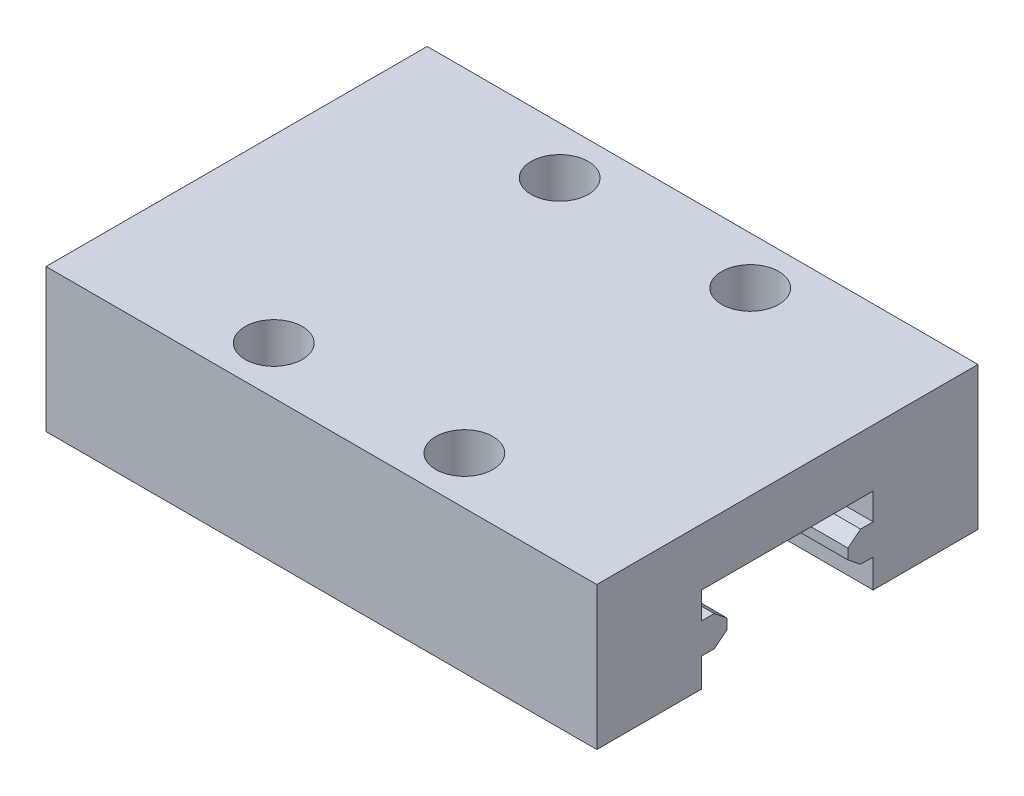
ISO-10303-21;
HEADER;
FILE_DESCRIPTION(('STEP AP214'),'2;1');
FILE_NAME('part.step','',(''),(''),'','','');
FILE_SCHEMA(('AUTOMOTIVE_DESIGN { 1 0 10303 214 1 1 1 1 }'));
ENDSEC;
DATA;
#1=APPLICATION_CONTEXT('core data for automotive mechanical design processes');
#2=APPLICATION_PROTOCOL_DEFINITION('international standard','automotive_design',2000,#1);
#3=PRODUCT_CONTEXT('',#1,'mechanical');
#4=PRODUCT('Part','Part','',(#3));
#5=PRODUCT_RELATED_PRODUCT_CATEGORY('part','',(#4));
#6=PRODUCT_DEFINITION_FORMATION('','',#4);
#7=PRODUCT_DEFINITION_CONTEXT('part definition',#1,'design');
#8=PRODUCT_DEFINITION('design','',#6,#7);
#9=PRODUCT_DEFINITION_SHAPE('','',#8);
#10=(LENGTH_UNIT() NAMED_UNIT(*) SI_UNIT(.MILLI.,.METRE.));
#11=(NAMED_UNIT(*) PLANE_ANGLE_UNIT() SI_UNIT($,.RADIAN.));
#12=(NAMED_UNIT(*) SI_UNIT($,.STERADIAN.) SOLID_ANGLE_UNIT());
#13=UNCERTAINTY_MEASURE_WITH_UNIT(LENGTH_MEASURE(1.E-05),#10,'distance_accuracy_value','');
#14=(GEOMETRIC_REPRESENTATION_CONTEXT(3) GLOBAL_UNCERTAINTY_ASSIGNED_CONTEXT((#13)) GLOBAL_UNIT_ASSIGNED_CONTEXT((#10,
#11,#12)) REPRESENTATION_CONTEXT('',''));
#15=CARTESIAN_POINT('',(0.,0.,0.));
#16=DIRECTION('',(0.,0.,1.));
#17=DIRECTION('',(1.,0.,0.));
#18=AXIS2_PLACEMENT_3D('',#15,#16,#17);
#19=CARTESIAN_POINT('',(28.9,2.03,-13.175));
#20=DIRECTION('',(0.,0.,-1.));
#21=DIRECTION('',(-1.,0.,0.));
#22=AXIS2_PLACEMENT_3D('',#19,#20,#21);
#23=PLANE('',#22);
#24=DIRECTION('',(-1.,0.,0.));
#25=VECTOR('',#24,1.);
#26=CARTESIAN_POINT('',(14.45,2.57,-13.175));
#27=LINE('',#26,#25);
#28=CARTESIAN_POINT('',(28.9,2.570000000625,-13.175));
#29=VERTEX_POINT('',#28);
#30=CARTESIAN_POINT('',(0.,2.570000000625,-13.175));
#31=VERTEX_POINT('',#30);
#32=EDGE_CURVE('E171',#29,#31,#27,.T.);
#33=ORIENTED_EDGE('',*,*,#32,.T.);
#34=DIRECTION('',(0.,1.,0.));
#35=VECTOR('',#34,1.);
#36=CARTESIAN_POINT('',(0.,2.3,-13.175));
#37=LINE('',#36,#35);
#38=CARTESIAN_POINT('',(0.,2.03000000125,-13.175));
#39=VERTEX_POINT('',#38);
#40=EDGE_CURVE('E158',#39,#31,#37,.T.);
#41=ORIENTED_EDGE('',*,*,#40,.F.);
#42=DIRECTION('',(1.,0.,0.));
#43=VECTOR('',#42,1.);
#44=CARTESIAN_POINT('',(14.45,2.03,-13.175));
#45=LINE('',#44,#43);
#46=CARTESIAN_POINT('',(28.9,2.030000000625,-13.175));
#47=VERTEX_POINT('',#46);
#48=EDGE_CURVE('E324',#39,#47,#45,.T.);
#49=ORIENTED_EDGE('',*,*,#48,.T.);
#50=DIRECTION('',(0.,-1.,0.));
#51=VECTOR('',#50,1.);
#52=CARTESIAN_POINT('',(28.9,2.3,-13.175));
#53=LINE('',#52,#51);
#54=EDGE_CURVE('E153',#29,#47,#53,.T.);
#55=ORIENTED_EDGE('',*,*,#54,.F.);
#56=EDGE_LOOP('',(#33,#41,#49,#55));
#57=FACE_BOUND('',#56,.T.);
#58=ADVANCED_FACE('F17',(#57),#23,.F.);
#59=CARTESIAN_POINT('',(0.,2.03,-6.825));
#60=DIRECTION('',(0.,0.,1.));
#61=DIRECTION('',(1.,0.,0.));
#62=AXIS2_PLACEMENT_3D('',#59,#60,#61);
#63=PLANE('',#62);
#64=DIRECTION('',(-1.,0.,0.));
#65=VECTOR('',#64,1.);
#66=CARTESIAN_POINT('',(14.45,2.03,-6.825));
#67=LINE('',#66,#65);
#68=CARTESIAN_POINT('',(28.9,2.030000000625,-6.825));
#69=VERTEX_POINT('',#68);
#70=CARTESIAN_POINT('',(0.,2.030000000625,-6.825));
#71=VERTEX_POINT('',#70);
#72=EDGE_CURVE('E319',#69,#71,#67,.T.);
#73=ORIENTED_EDGE('',*,*,#72,.T.);
#74=DIRECTION('',(0.,-1.,0.));
#75=VECTOR('',#74,1.);
#76=CARTESIAN_POINT('',(0.,2.3,-6.825));
#77=LINE('',#76,#75);
#78=CARTESIAN_POINT('',(0.,2.57000000125,-6.825));
#79=VERTEX_POINT('',#78);
#80=EDGE_CURVE('E179',#79,#71,#77,.T.);
#81=ORIENTED_EDGE('',*,*,#80,.F.);
#82=DIRECTION('',(1.,0.,0.));
#83=VECTOR('',#82,1.);
#84=CARTESIAN_POINT('',(14.45,2.57,-6.825));
#85=LINE('',#84,#83);
#86=CARTESIAN_POINT('',(28.9,2.570000000625,-6.825));
#87=VERTEX_POINT('',#86);
#88=EDGE_CURVE('E329',#79,#87,#85,.T.);
#89=ORIENTED_EDGE('',*,*,#88,.T.);
#90=DIRECTION('',(0.,1.,0.));
#91=VECTOR('',#90,1.);
#92=CARTESIAN_POINT('',(28.9,2.3,-6.825));
#93=LINE('',#92,#91);
#94=EDGE_CURVE('E177',#69,#87,#93,.T.);
#95=ORIENTED_EDGE('',*,*,#94,.F.);
#96=EDGE_LOOP('',(#73,#81,#89,#95));
#97=FACE_BOUND('',#96,.T.);
#98=ADVANCED_FACE('F368',(#97),#63,.F.);
#99=CARTESIAN_POINT('',(0.,2.57,-13.175));
#100=DIRECTION('',(0.,-0.78086880944303,-0.624695047554425));
#101=DIRECTION('',(0.,0.624695047554425,-0.78086880944303));
#102=AXIS2_PLACEMENT_3D('',#99,#100,#101);
#103=PLANE('',#102);
#104=DIRECTION('',(-1.,0.,0.));
#105=VECTOR('',#104,1.);
#106=CARTESIAN_POINT('',(14.45,3.1,-13.8375));
#107=LINE('',#106,#105);
#108=CARTESIAN_POINT('',(28.9,3.099999999375,-13.8375));
#109=VERTEX_POINT('',#108);
#110=CARTESIAN_POINT('',(0.,3.099999999375,-13.8375));
#111=VERTEX_POINT('',#110);
#112=EDGE_CURVE('E174',#109,#111,#107,.T.);
#113=ORIENTED_EDGE('',*,*,#112,.T.);
#114=DIRECTION('',(0.,0.624695047554425,-0.78086880944303));
#115=VECTOR('',#114,1.);
#116=CARTESIAN_POINT('',(0.,2.835,-13.50625));
#117=LINE('',#116,#115);
#118=EDGE_CURVE('E162',#31,#111,#117,.T.);
#119=ORIENTED_EDGE('',*,*,#118,.F.);
#120=ORIENTED_EDGE('',*,*,#32,.F.);
#121=DIRECTION('',(0.,-0.624695047554425,0.78086880944303));
#122=VECTOR('',#121,1.);
#123=CARTESIAN_POINT('',(28.9,2.835,-13.50625));
#124=LINE('',#123,#122);
#125=EDGE_CURVE('E175',#109,#29,#124,.T.);
#126=ORIENTED_EDGE('',*,*,#125,.F.);
#127=EDGE_LOOP('',(#113,#119,#120,#126));
#128=FACE_BOUND('',#127,.T.);
#129=ADVANCED_FACE('F170',(#128),#103,.F.);
#130=CARTESIAN_POINT('',(0.,3.1,-6.1625));
#131=DIRECTION('',(0.,-0.78086880944303,0.624695047554424));
#132=DIRECTION('',(0.,-0.624695047554424,-0.78086880944303));
#133=AXIS2_PLACEMENT_3D('',#130,#131,#132);
#134=PLANE('',#133);
#135=ORIENTED_EDGE('',*,*,#88,.F.);
#136=DIRECTION('',(0.,-0.624695047554424,-0.78086880944303));
#137=VECTOR('',#136,1.);
#138=CARTESIAN_POINT('',(0.,2.835,-6.49375));
#139=LINE('',#138,#137);
#140=CARTESIAN_POINT('',(0.,3.09999999875,-6.1625));
#141=VERTEX_POINT('',#140);
#142=EDGE_CURVE('E332',#141,#79,#139,.T.);
#143=ORIENTED_EDGE('',*,*,#142,.F.);
#144=DIRECTION('',(1.,0.,0.));
#145=VECTOR('',#144,1.);
#146=CARTESIAN_POINT('',(14.45,3.1,-6.1625));
#147=LINE('',#146,#145);
#148=CARTESIAN_POINT('',(28.9,3.099999999375,-6.1625));
#149=VERTEX_POINT('',#148);
#150=EDGE_CURVE('E302',#141,#149,#147,.T.);
#151=ORIENTED_EDGE('',*,*,#150,.T.);
#152=DIRECTION('',(0.,0.624695047554424,0.78086880944303));
#153=VECTOR('',#152,1.);
#154=CARTESIAN_POINT('',(28.9,2.835,-6.49375));
#155=LINE('',#154,#153);
#156=EDGE_CURVE('E327',#87,#149,#155,.T.);
#157=ORIENTED_EDGE('',*,*,#156,.F.);
#158=EDGE_LOOP('',(#135,#143,#151,#157));
#159=FACE_BOUND('',#158,.T.);
#160=ADVANCED_FACE('F360',(#159),#134,.F.);
#161=CARTESIAN_POINT('',(0.,1.5,-13.8375));
#162=DIRECTION('',(0.,0.780868809443031,-0.624695047554424));
#163=DIRECTION('',(0.,0.624695047554424,0.780868809443031));
#164=AXIS2_PLACEMENT_3D('',#161,#162,#163);
#165=PLANE('',#164);
#166=ORIENTED_EDGE('',*,*,#48,.F.);
#167=DIRECTION('',(0.,0.624695047554424,0.78086880944303));
#168=VECTOR('',#167,1.);
#169=CARTESIAN_POINT('',(0.,1.765,-13.50625));
#170=LINE('',#169,#168);
#171=CARTESIAN_POINT('',(0.,1.5,-13.8375));
#172=VERTEX_POINT('',#171);
#173=EDGE_CURVE('E165',#172,#39,#170,.T.);
#174=ORIENTED_EDGE('',*,*,#173,.F.);
#175=DIRECTION('',(1.,0.,0.));
#176=VECTOR('',#175,1.);
#177=CARTESIAN_POINT('',(14.45,1.5,-13.8375));
#178=LINE('',#177,#176);
#179=CARTESIAN_POINT('',(28.9,1.5,-13.8375));
#180=VERTEX_POINT('',#179);
#181=EDGE_CURVE('E295',#172,#180,#178,.T.);
#182=ORIENTED_EDGE('',*,*,#181,.T.);
#183=DIRECTION('',(0.,-0.624695047554424,-0.78086880944303));
#184=VECTOR('',#183,1.);
#185=CARTESIAN_POINT('',(28.9,1.765,-13.50625));
#186=LINE('',#185,#184);
#187=EDGE_CURVE('E322',#47,#180,#186,.T.);
#188=ORIENTED_EDGE('',*,*,#187,.F.);
#189=EDGE_LOOP('',(#166,#174,#182,#188));
#190=FACE_BOUND('',#189,.T.);
#191=ADVANCED_FACE('F407',(#190),#165,.F.);
#192=CARTESIAN_POINT('',(0.,2.03,-6.825));
#193=DIRECTION('',(0.,0.780868809443031,0.624695047554424));
#194=DIRECTION('',(0.,-0.624695047554424,0.780868809443031));
#195=AXIS2_PLACEMENT_3D('',#192,#193,#194);
#196=PLANE('',#195);
#197=DIRECTION('',(-1.,0.,0.));
#198=VECTOR('',#197,1.);
#199=CARTESIAN_POINT('',(14.45,1.5,-6.1625));
#200=LINE('',#199,#198);
#201=CARTESIAN_POINT('',(28.9,1.5,-6.1625));
#202=VERTEX_POINT('',#201);
#203=CARTESIAN_POINT('',(0.,1.5,-6.1625));
#204=VERTEX_POINT('',#203);
#205=EDGE_CURVE('E290',#202,#204,#200,.T.);
#206=ORIENTED_EDGE('',*,*,#205,.T.);
#207=DIRECTION('',(0.,-0.624695047554424,0.780868809443031));
#208=VECTOR('',#207,1.);
#209=CARTESIAN_POINT('',(0.,1.765,-6.49375));
#210=LINE('',#209,#208);
#211=EDGE_CURVE('E317',#71,#204,#210,.T.);
#212=ORIENTED_EDGE('',*,*,#211,.F.);
#213=ORIENTED_EDGE('',*,*,#72,.F.);
#214=DIRECTION('',(0.,0.624695047554424,-0.780868809443031));
#215=VECTOR('',#214,1.);
#216=CARTESIAN_POINT('',(28.9,1.765,-6.49375));
#217=LINE('',#216,#215);
#218=EDGE_CURVE('E314',#202,#69,#217,.T.);
#219=ORIENTED_EDGE('',*,*,#218,.F.);
#220=EDGE_LOOP('',(#206,#212,#213,#219));
#221=FACE_BOUND('',#220,.T.);
#222=ADVANCED_FACE('F366',(#221),#196,.F.);
#223=CARTESIAN_POINT('',(0.,3.1,-13.8375));
#224=DIRECTION('',(0.,-1.,0.));
#225=DIRECTION('',(0.,0.,-1.));
#226=AXIS2_PLACEMENT_3D('',#223,#224,#225);
#227=PLANE('',#226);
#228=DIRECTION('',(-1.,0.,0.));
#229=VECTOR('',#228,1.);
#230=CARTESIAN_POINT('',(14.45,3.1,-14.5));
#231=LINE('',#230,#229);
#232=CARTESIAN_POINT('',(28.9,3.099999999375,-14.5));
#233=VERTEX_POINT('',#232);
#234=CARTESIAN_POINT('',(0.,3.099999999375,-14.5));
#235=VERTEX_POINT('',#234);
#236=EDGE_CURVE('E282',#233,#235,#231,.T.);
#237=ORIENTED_EDGE('',*,*,#236,.T.);
#238=DIRECTION('',(0.,0.,-1.));
#239=VECTOR('',#238,1.);
#240=CARTESIAN_POINT('',(0.,3.1,-14.16875));
#241=LINE('',#240,#239);
#242=EDGE_CURVE('E311',#111,#235,#241,.T.);
#243=ORIENTED_EDGE('',*,*,#242,.F.);
#244=ORIENTED_EDGE('',*,*,#112,.F.);
#245=DIRECTION('',(0.,0.,1.));
#246=VECTOR('',#245,1.);
#247=CARTESIAN_POINT('',(28.9,3.1,-14.16875));
#248=LINE('',#247,#246);
#249=EDGE_CURVE('E308',#233,#109,#248,.T.);
#250=ORIENTED_EDGE('',*,*,#249,.F.);
#251=EDGE_LOOP('',(#237,#243,#244,#250));
#252=FACE_BOUND('',#251,.T.);
#253=ADVANCED_FACE('F338',(#252),#227,.F.);
#254=CARTESIAN_POINT('',(0.,3.1,-5.5));
#255=DIRECTION('',(0.,-1.,0.));
#256=DIRECTION('',(0.,0.,-1.));
#257=AXIS2_PLACEMENT_3D('',#254,#255,#256);
#258=PLANE('',#257);
#259=ORIENTED_EDGE('',*,*,#150,.F.);
#260=DIRECTION('',(0.,0.,-1.));
#261=VECTOR('',#260,1.);
#262=CARTESIAN_POINT('',(0.,3.1,-5.83125));
#263=LINE('',#262,#261);
#264=CARTESIAN_POINT('',(0.,3.09999999875,-5.5));
#265=VERTEX_POINT('',#264);
#266=EDGE_CURVE('E305',#265,#141,#263,.T.);
#267=ORIENTED_EDGE('',*,*,#266,.F.);
#268=DIRECTION('',(1.,0.,0.));
#269=VECTOR('',#268,1.);
#270=CARTESIAN_POINT('',(14.45,3.1,-5.5));
#271=LINE('',#270,#269);
#272=CARTESIAN_POINT('',(28.9,3.099999999375,-5.5));
#273=VERTEX_POINT('',#272);
#274=EDGE_CURVE('E271',#265,#273,#271,.T.);
#275=ORIENTED_EDGE('',*,*,#274,.T.);
#276=DIRECTION('',(0.,0.,1.));
#277=VECTOR('',#276,1.);
#278=CARTESIAN_POINT('',(28.9,3.1,-5.83125));
#279=LINE('',#278,#277);
#280=EDGE_CURVE('E300',#149,#273,#279,.T.);
#281=ORIENTED_EDGE('',*,*,#280,.F.);
#282=EDGE_LOOP('',(#259,#267,#275,#281));
#283=FACE_BOUND('',#282,.T.);
#284=ADVANCED_FACE('F356',(#283),#258,.F.);
#285=CARTESIAN_POINT('',(0.,1.5,-14.5));
#286=DIRECTION('',(0.,1.,0.));
#287=DIRECTION('',(0.,0.,1.));
#288=AXIS2_PLACEMENT_3D('',#285,#286,#287);
#289=PLANE('',#288);
#290=ORIENTED_EDGE('',*,*,#181,.F.);
#291=DIRECTION('',(0.,0.,1.));
#292=VECTOR('',#291,1.);
#293=CARTESIAN_POINT('',(0.,1.5,-14.16875));
#294=LINE('',#293,#292);
#295=CARTESIAN_POINT('',(0.,1.5,-14.5));
#296=VERTEX_POINT('',#295);
#297=EDGE_CURVE('E298',#296,#172,#294,.T.);
#298=ORIENTED_EDGE('',*,*,#297,.F.);
#299=DIRECTION('',(1.,0.,0.));
#300=VECTOR('',#299,1.);
#301=CARTESIAN_POINT('',(14.45,1.5,-14.5));
#302=LINE('',#301,#300);
#303=CARTESIAN_POINT('',(28.9,1.5,-14.5));
#304=VERTEX_POINT('',#303);
#305=EDGE_CURVE('E264',#296,#304,#302,.T.);
#306=ORIENTED_EDGE('',*,*,#305,.T.);
#307=DIRECTION('',(0.,0.,-1.));
#308=VECTOR('',#307,1.);
#309=CARTESIAN_POINT('',(28.9,1.5,-14.16875));
#310=LINE('',#309,#308);
#311=EDGE_CURVE('E293',#180,#304,#310,.T.);
#312=ORIENTED_EDGE('',*,*,#311,.F.);
#313=EDGE_LOOP('',(#290,#298,#306,#312));
#314=FACE_BOUND('',#313,.T.);
#315=ADVANCED_FACE('F405',(#314),#289,.F.);
#316=CARTESIAN_POINT('',(0.,1.5,-6.1625));
#317=DIRECTION('',(0.,1.,0.));
#318=DIRECTION('',(0.,0.,1.));
#319=AXIS2_PLACEMENT_3D('',#316,#317,#318);
#320=PLANE('',#319);
#321=DIRECTION('',(-1.,0.,0.));
#322=VECTOR('',#321,1.);
#323=CARTESIAN_POINT('',(14.45,1.5,-5.5));
#324=LINE('',#323,#322);
#325=CARTESIAN_POINT('',(28.9,1.5,-5.5));
#326=VERTEX_POINT('',#325);
#327=CARTESIAN_POINT('',(0.,1.5,-5.5));
#328=VERTEX_POINT('',#327);
#329=EDGE_CURVE('E259',#326,#328,#324,.T.);
#330=ORIENTED_EDGE('',*,*,#329,.T.);
#331=DIRECTION('',(0.,0.,1.));
#332=VECTOR('',#331,1.);
#333=CARTESIAN_POINT('',(0.,1.5,-5.83125));
#334=LINE('',#333,#332);
#335=EDGE_CURVE('E288',#204,#328,#334,.T.);
#336=ORIENTED_EDGE('',*,*,#335,.F.);
#337=ORIENTED_EDGE('',*,*,#205,.F.);
#338=DIRECTION('',(0.,0.,-1.));
#339=VECTOR('',#338,1.);
#340=CARTESIAN_POINT('',(28.9,1.5,-5.83125));
#341=LINE('',#340,#339);
#342=EDGE_CURVE('E285',#326,#202,#341,.T.);
#343=ORIENTED_EDGE('',*,*,#342,.F.);
#344=EDGE_LOOP('',(#330,#336,#337,#343));
#345=FACE_BOUND('',#344,.T.);
#346=ADVANCED_FACE('F370',(#345),#320,.F.);
#347=CARTESIAN_POINT('',(0.,3.1,-14.5));
#348=DIRECTION('',(0.,0.,-1.));
#349=DIRECTION('',(0.,1.,0.));
#350=AXIS2_PLACEMENT_3D('',#347,#348,#349);
#351=PLANE('',#350);
#352=DIRECTION('',(-1.,0.,0.));
#353=VECTOR('',#352,1.);
#354=CARTESIAN_POINT('',(14.45,4.5,-14.5));
#355=LINE('',#354,#353);
#356=CARTESIAN_POINT('',(28.9,4.5,-14.5));
#357=VERTEX_POINT('',#356);
#358=CARTESIAN_POINT('',(0.,4.5,-14.5));
#359=VERTEX_POINT('',#358);
#360=EDGE_CURVE('E251',#357,#359,#355,.T.);
#361=ORIENTED_EDGE('',*,*,#360,.T.);
#362=DIRECTION('',(0.,1.,0.));
#363=VECTOR('',#362,1.);
#364=CARTESIAN_POINT('',(0.,3.8,-14.5));
#365=LINE('',#364,#363);
#366=EDGE_CURVE('E280',#235,#359,#365,.T.);
#367=ORIENTED_EDGE('',*,*,#366,.F.);
#368=ORIENTED_EDGE('',*,*,#236,.F.);
#369=DIRECTION('',(0.,-1.,0.));
#370=VECTOR('',#369,1.);
#371=CARTESIAN_POINT('',(28.9,3.8,-14.5));
#372=LINE('',#371,#370);
#373=EDGE_CURVE('E277',#357,#233,#372,.T.);
#374=ORIENTED_EDGE('',*,*,#373,.F.);
#375=EDGE_LOOP('',(#361,#367,#368,#374));
#376=FACE_BOUND('',#375,.T.);
#377=ADVANCED_FACE('F343',(#376),#351,.F.);
#378=CARTESIAN_POINT('',(0.,3.1,-5.5));
#379=DIRECTION('',(0.,0.,1.));
#380=DIRECTION('',(1.,0.,0.));
#381=AXIS2_PLACEMENT_3D('',#378,#379,#380);
#382=PLANE('',#381);
#383=ORIENTED_EDGE('',*,*,#274,.F.);
#384=DIRECTION('',(0.,-1.,0.));
#385=VECTOR('',#384,1.);
#386=CARTESIAN_POINT('',(0.,3.8,-5.5));
#387=LINE('',#386,#385);
#388=CARTESIAN_POINT('',(0.,4.5,-5.5));
#389=VERTEX_POINT('',#388);
#390=EDGE_CURVE('E274',#389,#265,#387,.T.);
#391=ORIENTED_EDGE('',*,*,#390,.F.);
#392=DIRECTION('',(1.,0.,0.));
#393=VECTOR('',#392,1.);
#394=CARTESIAN_POINT('',(14.45,4.5,-5.5));
#395=LINE('',#394,#393);
#396=CARTESIAN_POINT('',(28.9,4.5,-5.5));
#397=VERTEX_POINT('',#396);
#398=EDGE_CURVE('E248',#389,#397,#395,.T.);
#399=ORIENTED_EDGE('',*,*,#398,.T.);
#400=DIRECTION('',(0.,1.,0.));
#401=VECTOR('',#400,1.);
#402=CARTESIAN_POINT('',(28.9,3.8,-5.5));
#403=LINE('',#402,#401);
#404=EDGE_CURVE('E269',#273,#397,#403,.T.);
#405=ORIENTED_EDGE('',*,*,#404,.F.);
#406=EDGE_LOOP('',(#383,#391,#399,#405));
#407=FACE_BOUND('',#406,.T.);
#408=ADVANCED_FACE('F351',(#407),#382,.F.);
#409=CARTESIAN_POINT('',(28.9,0.,-14.5));
#410=DIRECTION('',(0.,0.,-1.));
#411=DIRECTION('',(-1.,0.,0.));
#412=AXIS2_PLACEMENT_3D('',#409,#410,#411);
#413=PLANE('',#412);
#414=ORIENTED_EDGE('',*,*,#305,.F.);
#415=DIRECTION('',(0.,1.,0.));
#416=VECTOR('',#415,1.);
#417=CARTESIAN_POINT('',(0.,0.75,-14.5));
#418=LINE('',#417,#416);
#419=CARTESIAN_POINT('',(0.,0.,-14.5));
#420=VERTEX_POINT('',#419);
#421=EDGE_CURVE('E267',#420,#296,#418,.T.);
#422=ORIENTED_EDGE('',*,*,#421,.F.);
#423=DIRECTION('',(-1.,0.,0.));
#424=VECTOR('',#423,1.);
#425=CARTESIAN_POINT('',(14.45,0.,-14.5));
#426=LINE('',#425,#424);
#427=CARTESIAN_POINT('',(28.9,0.,-14.5));
#428=VERTEX_POINT('',#427);
#429=EDGE_CURVE('E245',#428,#420,#426,.T.);
#430=ORIENTED_EDGE('',*,*,#429,.F.);
#431=DIRECTION('',(0.,-1.,0.));
#432=VECTOR('',#431,1.);
#433=CARTESIAN_POINT('',(28.9,0.75,-14.5));
#434=LINE('',#433,#432);
#435=EDGE_CURVE('E262',#304,#428,#434,.T.);
#436=ORIENTED_EDGE('',*,*,#435,.F.);
#437=EDGE_LOOP('',(#414,#422,#430,#436));
#438=FACE_BOUND('',#437,.T.);
#439=ADVANCED_FACE('F400',(#438),#413,.F.);
#440=CARTESIAN_POINT('',(0.,0.,-5.5));
#441=DIRECTION('',(0.,0.,1.));
#442=DIRECTION('',(1.,0.,0.));
#443=AXIS2_PLACEMENT_3D('',#440,#441,#442);
#444=PLANE('',#443);
#445=DIRECTION('',(1.,0.,0.));
#446=VECTOR('',#445,1.);
#447=CARTESIAN_POINT('',(14.45,0.,-5.5));
#448=LINE('',#447,#446);
#449=CARTESIAN_POINT('',(0.,0.,-5.5));
#450=VERTEX_POINT('',#449);
#451=CARTESIAN_POINT('',(28.9,0.,-5.5));
#452=VERTEX_POINT('',#451);
#453=EDGE_CURVE('E242',#450,#452,#448,.T.);
#454=ORIENTED_EDGE('',*,*,#453,.F.);
#455=DIRECTION('',(0.,-1.,0.));
#456=VECTOR('',#455,1.);
#457=CARTESIAN_POINT('',(0.,0.75,-5.5));
#458=LINE('',#457,#456);
#459=EDGE_CURVE('E257',#328,#450,#458,.T.);
#460=ORIENTED_EDGE('',*,*,#459,.F.);
#461=ORIENTED_EDGE('',*,*,#329,.F.);
#462=DIRECTION('',(0.,1.,0.));
#463=VECTOR('',#462,1.);
#464=CARTESIAN_POINT('',(28.9,0.75,-5.5));
#465=LINE('',#464,#463);
#466=EDGE_CURVE('E254',#452,#326,#465,.T.);
#467=ORIENTED_EDGE('',*,*,#466,.F.);
#468=EDGE_LOOP('',(#454,#460,#461,#467));
#469=FACE_BOUND('',#468,.T.);
#470=ADVANCED_FACE('F375',(#469),#444,.F.);
#471=CARTESIAN_POINT('',(0.,4.5,-14.5));
#472=DIRECTION('',(0.,1.,0.));
#473=DIRECTION('',(0.,0.,1.));
#474=AXIS2_PLACEMENT_3D('',#471,#472,#473);
#475=PLANE('',#474);
#476=ORIENTED_EDGE('',*,*,#398,.F.);
#477=DIRECTION('',(0.,0.,-1.));
#478=VECTOR('',#477,1.);
#479=CARTESIAN_POINT('',(0.,4.5,-10.));
#480=LINE('',#479,#478);
#481=EDGE_CURVE('E237',#389,#359,#480,.T.);
#482=ORIENTED_EDGE('',*,*,#481,.T.);
#483=ORIENTED_EDGE('',*,*,#360,.F.);
#484=DIRECTION('',(0.,0.,1.));
#485=VECTOR('',#484,1.);
#486=CARTESIAN_POINT('',(28.9,4.5,-10.));
#487=LINE('',#486,#485);
#488=EDGE_CURVE('E227',#357,#397,#487,.T.);
#489=ORIENTED_EDGE('',*,*,#488,.T.);
#490=EDGE_LOOP('',(#476,#482,#483,#489));
#491=FACE_BOUND('',#490,.T.);
#492=ADVANCED_FACE('F348',(#491),#475,.F.);
#493=CARTESIAN_POINT('',(0.,0.,-14.5));
#494=DIRECTION('',(0.,-1.,0.));
#495=DIRECTION('',(0.,0.,-1.));
#496=AXIS2_PLACEMENT_3D('',#493,#494,#495);
#497=PLANE('',#496);
#498=DIRECTION('',(1.,0.,0.));
#499=VECTOR('',#498,1.);
#500=CARTESIAN_POINT('',(14.45,0.,-20.));
#501=LINE('',#500,#499);
#502=CARTESIAN_POINT('',(0.,0.,-20.));
#503=VERTEX_POINT('',#502);
#504=CARTESIAN_POINT('',(28.9,0.,-20.));
#505=VERTEX_POINT('',#504);
#506=EDGE_CURVE('E230',#503,#505,#501,.T.);
#507=ORIENTED_EDGE('',*,*,#506,.T.);
#508=DIRECTION('',(0.,0.,1.));
#509=VECTOR('',#508,1.);
#510=CARTESIAN_POINT('',(28.9,0.,-10.));
#511=LINE('',#510,#509);
#512=EDGE_CURVE('E219',#505,#428,#511,.T.);
#513=ORIENTED_EDGE('',*,*,#512,.T.);
#514=ORIENTED_EDGE('',*,*,#429,.T.);
#515=DIRECTION('',(0.,0.,-1.));
#516=VECTOR('',#515,1.);
#517=CARTESIAN_POINT('',(0.,0.,-10.));
#518=LINE('',#517,#516);
#519=EDGE_CURVE('E235',#420,#503,#518,.T.);
#520=ORIENTED_EDGE('',*,*,#519,.T.);
#521=EDGE_LOOP('',(#507,#513,#514,#520));
#522=FACE_BOUND('',#521,.T.);
#523=ADVANCED_FACE('F396',(#522),#497,.T.);
#524=CARTESIAN_POINT('',(0.,0.,0.));
#525=DIRECTION('',(0.,-1.,0.));
#526=DIRECTION('',(0.,0.,-1.));
#527=AXIS2_PLACEMENT_3D('',#524,#525,#526);
#528=PLANE('',#527);
#529=DIRECTION('',(-1.,0.,0.));
#530=VECTOR('',#529,1.);
#531=CARTESIAN_POINT('',(14.45,0.,0.));
#532=LINE('',#531,#530);
#533=CARTESIAN_POINT('',(28.9,0.,0.));
#534=VERTEX_POINT('',#533);
#535=CARTESIAN_POINT('',(0.,0.,0.));
#536=VERTEX_POINT('',#535);
#537=EDGE_CURVE('E205',#534,#536,#532,.T.);
#538=ORIENTED_EDGE('',*,*,#537,.T.);
#539=DIRECTION('',(0.,0.,-1.));
#540=VECTOR('',#539,1.);
#541=CARTESIAN_POINT('',(0.,0.,-10.));
#542=LINE('',#541,#540);
#543=EDGE_CURVE('E240',#536,#450,#542,.T.);
#544=ORIENTED_EDGE('',*,*,#543,.T.);
#545=ORIENTED_EDGE('',*,*,#453,.T.);
#546=DIRECTION('',(0.,0.,1.));
#547=VECTOR('',#546,1.);
#548=CARTESIAN_POINT('',(28.9,0.,-10.));
#549=LINE('',#548,#547);
#550=EDGE_CURVE('E225',#452,#534,#549,.T.);
#551=ORIENTED_EDGE('',*,*,#550,.T.);
#552=EDGE_LOOP('',(#538,#544,#545,#551));
#553=FACE_BOUND('',#552,.T.);
#554=ADVANCED_FACE('F377',(#553),#528,.T.);
#555=CARTESIAN_POINT('',(17.932,4.5,-15.982));
#556=DIRECTION('',(0.,-1.,0.));
#557=DIRECTION('',(0.,0.,-1.));
#558=AXIS2_PLACEMENT_3D('',#555,#556,#557);
#559=PLANE('',#558);
#560=CARTESIAN_POINT('',(19.45,4.5,-17.5));
#561=DIRECTION('',(0.,1.,0.));
#562=DIRECTION('',(0.,0.,1.));
#563=AXIS2_PLACEMENT_3D('',#560,#561,#562);
#564=CIRCLE('',#563,1.5);
#565=CARTESIAN_POINT('',(19.45,4.5,-16.));
#566=VERTEX_POINT('',#565);
#567=EDGE_CURVE('E21',#566,#566,#564,.F.);
#568=ORIENTED_EDGE('',*,*,#567,.F.);
#569=EDGE_LOOP('',(#568));
#570=FACE_BOUND('',#569,.T.);
#571=ADVANCED_FACE('F555',(#570),#559,.F.);
#572=CARTESIAN_POINT('',(7.932,4.5,-0.982));
#573=DIRECTION('',(0.,-1.,0.));
#574=DIRECTION('',(0.,0.,-1.));
#575=AXIS2_PLACEMENT_3D('',#572,#573,#574);
#576=PLANE('',#575);
#577=CARTESIAN_POINT('',(9.45,4.5,-2.5));
#578=DIRECTION('',(0.,1.,0.));
#579=DIRECTION('',(0.,0.,1.));
#580=AXIS2_PLACEMENT_3D('',#577,#578,#579);
#581=CIRCLE('',#580,1.5);
#582=CARTESIAN_POINT('',(9.45,4.5,-1.));
#583=VERTEX_POINT('',#582);
#584=EDGE_CURVE('E200',#583,#583,#581,.F.);
#585=ORIENTED_EDGE('',*,*,#584,.F.);
#586=EDGE_LOOP('',(#585));
#587=FACE_BOUND('',#586,.T.);
#588=ADVANCED_FACE('F564',(#587),#576,.F.);
#589=CARTESIAN_POINT('',(7.932,4.5,-19.018));
#590=DIRECTION('',(0.,1.,0.));
#591=DIRECTION('',(0.,0.,1.));
#592=AXIS2_PLACEMENT_3D('',#589,#590,#591);
#593=PLANE('',#592);
#594=CARTESIAN_POINT('',(9.45,4.5,-17.5));
#595=DIRECTION('',(0.,1.,0.));
#596=DIRECTION('',(0.,0.,1.));
#597=AXIS2_PLACEMENT_3D('',#594,#595,#596);
#598=CIRCLE('',#597,1.5);
#599=CARTESIAN_POINT('',(9.45,4.5,-16.));
#600=VERTEX_POINT('',#599);
#601=EDGE_CURVE('E197',#600,#600,#598,.F.);
#602=ORIENTED_EDGE('',*,*,#601,.F.);
#603=EDGE_LOOP('',(#602));
#604=FACE_BOUND('',#603,.T.);
#605=ADVANCED_FACE('F574',(#604),#593,.T.);
#606=CARTESIAN_POINT('',(0.,0.,0.));
#607=DIRECTION('',(1.,0.,0.));
#608=DIRECTION('',(0.,0.,-1.));
#609=AXIS2_PLACEMENT_3D('',#606,#607,#608);
#610=PLANE('',#609);
#611=ORIENTED_EDGE('',*,*,#421,.T.);
#612=ORIENTED_EDGE('',*,*,#297,.T.);
#613=ORIENTED_EDGE('',*,*,#173,.T.);
#614=ORIENTED_EDGE('',*,*,#40,.T.);
#615=ORIENTED_EDGE('',*,*,#118,.T.);
#616=ORIENTED_EDGE('',*,*,#242,.T.);
#617=ORIENTED_EDGE('',*,*,#366,.T.);
#618=ORIENTED_EDGE('',*,*,#481,.F.);
#619=ORIENTED_EDGE('',*,*,#390,.T.);
#620=ORIENTED_EDGE('',*,*,#266,.T.);
#621=ORIENTED_EDGE('',*,*,#142,.T.);
#622=ORIENTED_EDGE('',*,*,#80,.T.);
#623=ORIENTED_EDGE('',*,*,#211,.T.);
#624=ORIENTED_EDGE('',*,*,#335,.T.);
#625=ORIENTED_EDGE('',*,*,#459,.T.);
#626=ORIENTED_EDGE('',*,*,#543,.F.);
#627=DIRECTION('',(0.,1.,0.));
#628=VECTOR('',#627,1.);
#629=CARTESIAN_POINT('',(0.,3.75,0.));
#630=LINE('',#629,#628);
#631=CARTESIAN_POINT('',(0.,7.5,0.));
#632=VERTEX_POINT('',#631);
#633=EDGE_CURVE('E212',#536,#632,#630,.T.);
#634=ORIENTED_EDGE('',*,*,#633,.T.);
#635=DIRECTION('',(0.,0.,-1.));
#636=VECTOR('',#635,1.);
#637=CARTESIAN_POINT('',(0.,7.5,-10.));
#638=LINE('',#637,#636);
#639=CARTESIAN_POINT('',(0.,7.5,-20.));
#640=VERTEX_POINT('',#639);
#641=EDGE_CURVE('E199',#632,#640,#638,.T.);
#642=ORIENTED_EDGE('',*,*,#641,.T.);
#643=DIRECTION('',(0.,-1.,0.));
#644=VECTOR('',#643,1.);
#645=CARTESIAN_POINT('',(0.,3.75,-20.));
#646=LINE('',#645,#644);
#647=EDGE_CURVE('E232',#640,#503,#646,.T.);
#648=ORIENTED_EDGE('',*,*,#647,.T.);
#649=ORIENTED_EDGE('',*,*,#519,.F.);
#650=EDGE_LOOP('',(#611,#612,#613,#614,#615,#616,#617,#618,#619,#620,#621,#622,#623,#624,#625,
#626,#634,#642,#648,#649));
#651=FACE_BOUND('',#650,.T.);
#652=ADVANCED_FACE('F161',(#651),#610,.F.);
#653=CARTESIAN_POINT('',(0.,0.,-20.));
#654=DIRECTION('',(0.,0.,1.));
#655=DIRECTION('',(1.,0.,0.));
#656=AXIS2_PLACEMENT_3D('',#653,#654,#655);
#657=PLANE('',#656);
#658=ORIENTED_EDGE('',*,*,#647,.F.);
#659=DIRECTION('',(1.,0.,0.));
#660=VECTOR('',#659,1.);
#661=CARTESIAN_POINT('',(14.45,7.5,-20.));
#662=LINE('',#661,#660);
#663=CARTESIAN_POINT('',(28.9,7.5,-20.));
#664=VERTEX_POINT('',#663);
#665=EDGE_CURVE('E386',#640,#664,#662,.T.);
#666=ORIENTED_EDGE('',*,*,#665,.T.);
#667=DIRECTION('',(0.,-1.,0.));
#668=VECTOR('',#667,1.);
#669=CARTESIAN_POINT('',(28.9,3.75,-20.));
#670=LINE('',#669,#668);
#671=EDGE_CURVE('E222',#664,#505,#670,.T.);
#672=ORIENTED_EDGE('',*,*,#671,.T.);
#673=ORIENTED_EDGE('',*,*,#506,.F.);
#674=EDGE_LOOP('',(#658,#666,#672,#673));
#675=FACE_BOUND('',#674,.T.);
#676=ADVANCED_FACE('F394',(#675),#657,.F.);
#677=CARTESIAN_POINT('',(28.9,0.,-20.));
#678=DIRECTION('',(-1.,0.,0.));
#679=DIRECTION('',(0.,0.,1.));
#680=AXIS2_PLACEMENT_3D('',#677,#678,#679);
#681=PLANE('',#680);
#682=ORIENTED_EDGE('',*,*,#435,.T.);
#683=ORIENTED_EDGE('',*,*,#512,.F.);
#684=ORIENTED_EDGE('',*,*,#671,.F.);
#685=DIRECTION('',(0.,0.,1.));
#686=VECTOR('',#685,1.);
#687=CARTESIAN_POINT('',(28.9,7.5,-10.));
#688=LINE('',#687,#686);
#689=CARTESIAN_POINT('',(28.9,7.5,0.));
#690=VERTEX_POINT('',#689);
#691=EDGE_CURVE('E384',#664,#690,#688,.T.);
#692=ORIENTED_EDGE('',*,*,#691,.T.);
#693=DIRECTION('',(0.,-1.,0.));
#694=VECTOR('',#693,1.);
#695=CARTESIAN_POINT('',(28.9,3.75,0.));
#696=LINE('',#695,#694);
#697=EDGE_CURVE('E36',#690,#534,#696,.T.);
#698=ORIENTED_EDGE('',*,*,#697,.T.);
#699=ORIENTED_EDGE('',*,*,#550,.F.);
#700=ORIENTED_EDGE('',*,*,#466,.T.);
#701=ORIENTED_EDGE('',*,*,#342,.T.);
#702=ORIENTED_EDGE('',*,*,#218,.T.);
#703=ORIENTED_EDGE('',*,*,#94,.T.);
#704=ORIENTED_EDGE('',*,*,#156,.T.);
#705=ORIENTED_EDGE('',*,*,#280,.T.);
#706=ORIENTED_EDGE('',*,*,#404,.T.);
#707=ORIENTED_EDGE('',*,*,#488,.F.);
#708=ORIENTED_EDGE('',*,*,#373,.T.);
#709=ORIENTED_EDGE('',*,*,#249,.T.);
#710=ORIENTED_EDGE('',*,*,#125,.T.);
#711=ORIENTED_EDGE('',*,*,#54,.T.);
#712=ORIENTED_EDGE('',*,*,#187,.T.);
#713=ORIENTED_EDGE('',*,*,#311,.T.);
#714=EDGE_LOOP('',(#682,#683,#684,#692,#698,#699,#700,#701,#702,#703,#704,#705,#706,#707,#708,
#709,#710,#711,#712,#713));
#715=FACE_BOUND('',#714,.T.);
#716=ADVANCED_FACE('F335',(#715),#681,.F.);
#717=CARTESIAN_POINT('',(28.9,0.,0.));
#718=DIRECTION('',(0.,0.,-1.));
#719=DIRECTION('',(-1.,0.,0.));
#720=AXIS2_PLACEMENT_3D('',#717,#718,#719);
#721=PLANE('',#720);
#722=ORIENTED_EDGE('',*,*,#697,.F.);
#723=DIRECTION('',(-1.,0.,0.));
#724=VECTOR('',#723,1.);
#725=CARTESIAN_POINT('',(14.45,7.5,0.));
#726=LINE('',#725,#724);
#727=EDGE_CURVE('E196',#690,#632,#726,.T.);
#728=ORIENTED_EDGE('',*,*,#727,.T.);
#729=ORIENTED_EDGE('',*,*,#633,.F.);
#730=ORIENTED_EDGE('',*,*,#537,.F.);
#731=EDGE_LOOP('',(#722,#728,#729,#730));
#732=FACE_BOUND('',#731,.T.);
#733=ADVANCED_FACE('F380',(#732),#721,.F.);
#734=CARTESIAN_POINT('',(19.45,4.5,-17.5));
#735=DIRECTION('',(0.,1.,0.));
#736=DIRECTION('',(0.,0.,1.));
#737=AXIS2_PLACEMENT_3D('',#734,#735,#736);
#738=CYLINDRICAL_SURFACE('',#737,1.5);
#739=ORIENTED_EDGE('',*,*,#567,.T.);
#740=EDGE_LOOP('',(#739));
#741=FACE_BOUND('',#740,.T.);
#742=CARTESIAN_POINT('',(19.45,7.5,-17.5));
#743=DIRECTION('',(0.,1.,0.));
#744=DIRECTION('',(0.,0.,1.));
#745=AXIS2_PLACEMENT_3D('',#742,#743,#744);
#746=CIRCLE('',#745,1.5);
#747=CARTESIAN_POINT('',(19.45,7.5,-16.));
#748=VERTEX_POINT('',#747);
#749=EDGE_CURVE('E193',#748,#748,#746,.T.);
#750=ORIENTED_EDGE('',*,*,#749,.T.);
#751=EDGE_LOOP('',(#750));
#752=FACE_BOUND('',#751,.T.);
#753=ADVANCED_FACE('F435',(#741,#752),#738,.F.);
#754=CARTESIAN_POINT('',(9.45,4.5,-2.5));
#755=DIRECTION('',(0.,1.,0.));
#756=DIRECTION('',(0.,0.,1.));
#757=AXIS2_PLACEMENT_3D('',#754,#755,#756);
#758=CYLINDRICAL_SURFACE('',#757,1.5);
#759=ORIENTED_EDGE('',*,*,#584,.T.);
#760=EDGE_LOOP('',(#759));
#761=FACE_BOUND('',#760,.T.);
#762=CARTESIAN_POINT('',(9.45,7.5,-2.5));
#763=DIRECTION('',(0.,1.,0.));
#764=DIRECTION('',(0.,0.,1.));
#765=AXIS2_PLACEMENT_3D('',#762,#763,#764);
#766=CIRCLE('',#765,1.5);
#767=CARTESIAN_POINT('',(9.45,7.5,-1.));
#768=VERTEX_POINT('',#767);
#769=EDGE_CURVE('E190',#768,#768,#766,.T.);
#770=ORIENTED_EDGE('',*,*,#769,.T.);
#771=EDGE_LOOP('',(#770));
#772=FACE_BOUND('',#771,.T.);
#773=ADVANCED_FACE('F431',(#761,#772),#758,.F.);
#774=CARTESIAN_POINT('',(9.45,4.5,-17.5));
#775=DIRECTION('',(0.,1.,0.));
#776=DIRECTION('',(0.,0.,1.));
#777=AXIS2_PLACEMENT_3D('',#774,#775,#776);
#778=CYLINDRICAL_SURFACE('',#777,1.5);
#779=ORIENTED_EDGE('',*,*,#601,.T.);
#780=EDGE_LOOP('',(#779));
#781=FACE_BOUND('',#780,.T.);
#782=CARTESIAN_POINT('',(9.45,7.5,-17.5));
#783=DIRECTION('',(0.,1.,0.));
#784=DIRECTION('',(0.,0.,1.));
#785=AXIS2_PLACEMENT_3D('',#782,#783,#784);
#786=CIRCLE('',#785,1.5);
#787=CARTESIAN_POINT('',(9.45,7.5,-16.));
#788=VERTEX_POINT('',#787);
#789=EDGE_CURVE('E187',#788,#788,#786,.T.);
#790=ORIENTED_EDGE('',*,*,#789,.T.);
#791=EDGE_LOOP('',(#790));
#792=FACE_BOUND('',#791,.T.);
#793=ADVANCED_FACE('F428',(#781,#792),#778,.F.);
#794=CARTESIAN_POINT('',(17.932,4.5,-4.018));
#795=DIRECTION('',(0.,1.,0.));
#796=DIRECTION('',(0.,0.,1.));
#797=AXIS2_PLACEMENT_3D('',#794,#795,#796);
#798=PLANE('',#797);
#799=CARTESIAN_POINT('',(19.45,4.5,-2.5));
#800=DIRECTION('',(0.,1.,0.));
#801=DIRECTION('',(0.,0.,1.));
#802=AXIS2_PLACEMENT_3D('',#799,#800,#801);
#803=CIRCLE('',#802,1.5);
#804=CARTESIAN_POINT('',(19.45,4.5,-1.));
#805=VERTEX_POINT('',#804);
#806=EDGE_CURVE('E27',#805,#805,#803,.F.);
#807=ORIENTED_EDGE('',*,*,#806,.F.);
#808=EDGE_LOOP('',(#807));
#809=FACE_BOUND('',#808,.T.);
#810=ADVANCED_FACE('F424',(#809),#798,.T.);
#811=CARTESIAN_POINT('',(0.,7.5,0.));
#812=DIRECTION('',(0.,-1.,0.));
#813=DIRECTION('',(0.,0.,-1.));
#814=AXIS2_PLACEMENT_3D('',#811,#812,#813);
#815=PLANE('',#814);
#816=ORIENTED_EDGE('',*,*,#789,.F.);
#817=EDGE_LOOP('',(#816));
#818=FACE_BOUND('',#817,.T.);
#819=ORIENTED_EDGE('',*,*,#769,.F.);
#820=EDGE_LOOP('',(#819));
#821=FACE_BOUND('',#820,.T.);
#822=ORIENTED_EDGE('',*,*,#749,.F.);
#823=EDGE_LOOP('',(#822));
#824=FACE_BOUND('',#823,.T.);
#825=CARTESIAN_POINT('',(19.45,7.5,-2.5));
#826=DIRECTION('',(0.,1.,0.));
#827=DIRECTION('',(0.,0.,1.));
#828=AXIS2_PLACEMENT_3D('',#825,#826,#827);
#829=CIRCLE('',#828,1.5);
#830=CARTESIAN_POINT('',(19.45,7.5,-1.));
#831=VERTEX_POINT('',#830);
#832=EDGE_CURVE('E11',#831,#831,#829,.T.);
#833=ORIENTED_EDGE('',*,*,#832,.F.);
#834=EDGE_LOOP('',(#833));
#835=FACE_BOUND('',#834,.T.);
#836=ORIENTED_EDGE('',*,*,#691,.F.);
#837=ORIENTED_EDGE('',*,*,#665,.F.);
#838=ORIENTED_EDGE('',*,*,#641,.F.);
#839=ORIENTED_EDGE('',*,*,#727,.F.);
#840=EDGE_LOOP('',(#836,#837,#838,#839));
#841=FACE_BOUND('',#840,.T.);
#842=ADVANCED_FACE('F19',(#818,#821,#824,#835,#841),#815,.F.);
#843=CARTESIAN_POINT('',(19.45,4.5,-2.5));
#844=DIRECTION('',(0.,1.,0.));
#845=DIRECTION('',(0.,0.,1.));
#846=AXIS2_PLACEMENT_3D('',#843,#844,#845);
#847=CYLINDRICAL_SURFACE('',#846,1.5);
#848=ORIENTED_EDGE('',*,*,#832,.T.);
#849=EDGE_LOOP('',(#848));
#850=FACE_BOUND('',#849,.T.);
#851=ORIENTED_EDGE('',*,*,#806,.T.);
#852=EDGE_LOOP('',(#851));
#853=FACE_BOUND('',#852,.T.);
#854=ADVANCED_FACE('F417',(#850,#853),#847,.F.);
#855=CLOSED_SHELL('',(#58,#98,#129,#160,#191,#222,#253,#284,#315,#346,#377,#408,#439,#470,#492,
#523,#554,#571,#588,#605,#652,#676,#716,#733,#753,#773,#793,#810,#842,#854));
#856=MANIFOLD_SOLID_BREP('B1',#855);
#857=ADVANCED_BREP_SHAPE_REPRESENTATION('',(#18,#856),#14);
#858=SHAPE_DEFINITION_REPRESENTATION(#9,#857);
ENDSEC;
END-ISO-10303-21;
